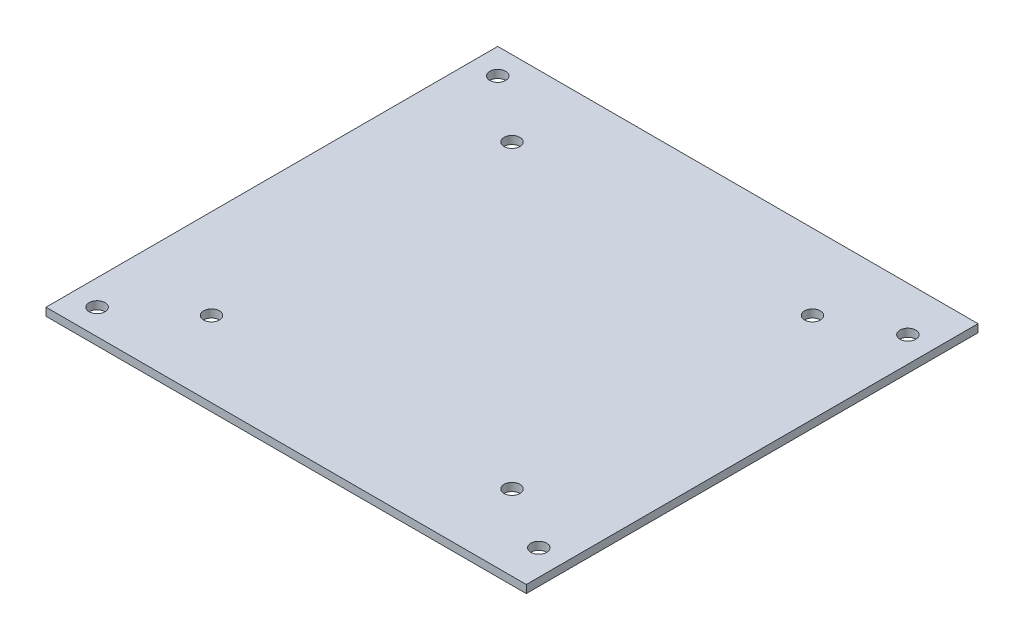
ISO-10303-21;
HEADER;
FILE_DESCRIPTION(('STEP AP214'),'2;1');
FILE_NAME('part.step','',(''),(''),'','','');
FILE_SCHEMA(('AUTOMOTIVE_DESIGN { 1 0 10303 214 1 1 1 1 }'));
ENDSEC;
DATA;
#1=APPLICATION_CONTEXT('core data for automotive mechanical design processes');
#2=APPLICATION_PROTOCOL_DEFINITION('international standard','automotive_design',2000,#1);
#3=PRODUCT_CONTEXT('',#1,'mechanical');
#4=PRODUCT('Part','Part','',(#3));
#5=PRODUCT_RELATED_PRODUCT_CATEGORY('part','',(#4));
#6=PRODUCT_DEFINITION_FORMATION('','',#4);
#7=PRODUCT_DEFINITION_CONTEXT('part definition',#1,'design');
#8=PRODUCT_DEFINITION('design','',#6,#7);
#9=PRODUCT_DEFINITION_SHAPE('','',#8);
#10=(LENGTH_UNIT() NAMED_UNIT(*) SI_UNIT(.MILLI.,.METRE.));
#11=(NAMED_UNIT(*) PLANE_ANGLE_UNIT() SI_UNIT($,.RADIAN.));
#12=(NAMED_UNIT(*) SI_UNIT($,.STERADIAN.) SOLID_ANGLE_UNIT());
#13=UNCERTAINTY_MEASURE_WITH_UNIT(LENGTH_MEASURE(1.E-05),#10,'distance_accuracy_value','');
#14=(GEOMETRIC_REPRESENTATION_CONTEXT(3) GLOBAL_UNCERTAINTY_ASSIGNED_CONTEXT((#13)) GLOBAL_UNIT_ASSIGNED_CONTEXT((#10,
#11,#12)) REPRESENTATION_CONTEXT('',''));
#15=CARTESIAN_POINT('',(0.,0.,0.));
#16=DIRECTION('',(0.,0.,1.));
#17=DIRECTION('',(1.,0.,0.));
#18=AXIS2_PLACEMENT_3D('',#15,#16,#17);
#19=CARTESIAN_POINT('',(0.,1.58,0.));
#20=DIRECTION('',(0.,1.,0.));
#21=DIRECTION('',(0.,0.,1.));
#22=AXIS2_PLACEMENT_3D('',#19,#20,#21);
#23=PLANE('',#22);
#24=CARTESIAN_POINT('',(42.85,1.58,37.5));
#25=DIRECTION('',(0.,1.,0.));
#26=DIRECTION('',(0.,0.,1.));
#27=AXIS2_PLACEMENT_3D('',#24,#25,#26);
#28=CIRCLE('',#27,1.5875);
#29=CARTESIAN_POINT('',(42.85,1.58,39.0875));
#30=VERTEX_POINT('',#29);
#31=EDGE_CURVE('E295',#30,#30,#28,.T.);
#32=ORIENTED_EDGE('',*,*,#31,.F.);
#33=EDGE_LOOP('',(#32));
#34=FACE_BOUND('',#33,.T.);
#35=CARTESIAN_POINT('',(30.,1.58,-30.));
#36=DIRECTION('',(0.,1.,0.));
#37=DIRECTION('',(0.,0.,1.));
#38=AXIS2_PLACEMENT_3D('',#35,#36,#37);
#39=CIRCLE('',#38,1.5875);
#40=CARTESIAN_POINT('',(30.,1.58,-28.4125));
#41=VERTEX_POINT('',#40);
#42=EDGE_CURVE('E307',#41,#41,#39,.T.);
#43=ORIENTED_EDGE('',*,*,#42,.F.);
#44=EDGE_LOOP('',(#43));
#45=FACE_BOUND('',#44,.T.);
#46=CARTESIAN_POINT('',(-30.,1.58,-29.9999999999983));
#47=DIRECTION('',(0.,1.,0.));
#48=DIRECTION('',(0.,0.,1.));
#49=AXIS2_PLACEMENT_3D('',#46,#47,#48);
#50=CIRCLE('',#49,1.5875);
#51=CARTESIAN_POINT('',(-30.,1.58,-28.4124999999983));
#52=VERTEX_POINT('',#51);
#53=EDGE_CURVE('E319',#52,#52,#50,.T.);
#54=ORIENTED_EDGE('',*,*,#53,.F.);
#55=EDGE_LOOP('',(#54));
#56=FACE_BOUND('',#55,.T.);
#57=CARTESIAN_POINT('',(-29.9999999999983,1.58,30.0000000000017));
#58=DIRECTION('',(0.,1.,0.));
#59=DIRECTION('',(0.,0.,1.));
#60=AXIS2_PLACEMENT_3D('',#57,#58,#59);
#61=CIRCLE('',#60,1.5875);
#62=CARTESIAN_POINT('',(-29.9999999999983,1.58,31.5875000000017));
#63=VERTEX_POINT('',#62);
#64=EDGE_CURVE('E224',#63,#63,#61,.T.);
#65=ORIENTED_EDGE('',*,*,#64,.F.);
#66=EDGE_LOOP('',(#65));
#67=FACE_BOUND('',#66,.T.);
#68=DIRECTION('',(1.,0.,0.));
#69=VECTOR('',#68,1.);
#70=CARTESIAN_POINT('',(-47.95,1.58,-45.1));
#71=LINE('',#70,#69);
#72=CARTESIAN_POINT('',(-47.95,1.58,-45.1));
#73=VERTEX_POINT('',#72);
#74=CARTESIAN_POINT('',(47.95,1.58,-45.1));
#75=VERTEX_POINT('',#74);
#76=EDGE_CURVE('E213',#73,#75,#71,.T.);
#77=ORIENTED_EDGE('',*,*,#76,.F.);
#78=DIRECTION('',(0.,0.,-1.));
#79=VECTOR('',#78,1.);
#80=CARTESIAN_POINT('',(-47.95,1.58,45.1));
#81=LINE('',#80,#79);
#82=CARTESIAN_POINT('',(-47.95,1.58,45.1));
#83=VERTEX_POINT('',#82);
#84=EDGE_CURVE('E203',#83,#73,#81,.T.);
#85=ORIENTED_EDGE('',*,*,#84,.F.);
#86=DIRECTION('',(1.,0.,0.));
#87=VECTOR('',#86,1.);
#88=CARTESIAN_POINT('',(-47.95,1.58,45.1));
#89=LINE('',#88,#87);
#90=CARTESIAN_POINT('',(47.95,1.58,45.1));
#91=VERTEX_POINT('',#90);
#92=EDGE_CURVE('E200',#83,#91,#89,.T.);
#93=ORIENTED_EDGE('',*,*,#92,.T.);
#94=DIRECTION('',(0.,0.,-1.));
#95=VECTOR('',#94,1.);
#96=CARTESIAN_POINT('',(47.95,1.58,45.1));
#97=LINE('',#96,#95);
#98=EDGE_CURVE('E197',#91,#75,#97,.T.);
#99=ORIENTED_EDGE('',*,*,#98,.T.);
#100=EDGE_LOOP('',(#77,#85,#93,#99));
#101=FACE_BOUND('',#100,.T.);
#102=CARTESIAN_POINT('',(-42.85,1.58,40.));
#103=DIRECTION('',(0.,1.,0.));
#104=DIRECTION('',(0.,0.,1.));
#105=AXIS2_PLACEMENT_3D('',#102,#103,#104);
#106=CIRCLE('',#105,1.5875);
#107=CARTESIAN_POINT('',(-42.85,1.58,41.5875));
#108=VERTEX_POINT('',#107);
#109=EDGE_CURVE('E325',#108,#108,#106,.T.);
#110=ORIENTED_EDGE('',*,*,#109,.F.);
#111=EDGE_LOOP('',(#110));
#112=FACE_BOUND('',#111,.T.);
#113=CARTESIAN_POINT('',(42.85,1.58,-36.2));
#114=DIRECTION('',(0.,1.,0.));
#115=DIRECTION('',(0.,0.,1.));
#116=AXIS2_PLACEMENT_3D('',#113,#114,#115);
#117=CIRCLE('',#116,1.5875);
#118=CARTESIAN_POINT('',(42.85,1.58,-34.6125));
#119=VERTEX_POINT('',#118);
#120=EDGE_CURVE('E313',#119,#119,#117,.T.);
#121=ORIENTED_EDGE('',*,*,#120,.F.);
#122=EDGE_LOOP('',(#121));
#123=FACE_BOUND('',#122,.T.);
#124=CARTESIAN_POINT('',(30.0000000000017,1.58,30.));
#125=DIRECTION('',(0.,1.,0.));
#126=DIRECTION('',(0.,0.,1.));
#127=AXIS2_PLACEMENT_3D('',#124,#125,#126);
#128=CIRCLE('',#127,1.5875);
#129=CARTESIAN_POINT('',(30.0000000000017,1.58,31.5875));
#130=VERTEX_POINT('',#129);
#131=EDGE_CURVE('E301',#130,#130,#128,.T.);
#132=ORIENTED_EDGE('',*,*,#131,.F.);
#133=EDGE_LOOP('',(#132));
#134=FACE_BOUND('',#133,.T.);
#135=CARTESIAN_POINT('',(-42.85,1.58,-40.));
#136=DIRECTION('',(0.,1.,0.));
#137=DIRECTION('',(0.,0.,1.));
#138=AXIS2_PLACEMENT_3D('',#135,#136,#137);
#139=CIRCLE('',#138,1.5875);
#140=CARTESIAN_POINT('',(-42.85,1.58,-38.4125));
#141=VERTEX_POINT('',#140);
#142=EDGE_CURVE('E286',#141,#141,#139,.T.);
#143=ORIENTED_EDGE('',*,*,#142,.F.);
#144=EDGE_LOOP('',(#143));
#145=FACE_BOUND('',#144,.T.);
#146=ADVANCED_FACE('F154',(#34,#45,#56,#67,#101,#112,#123,#134,#145),#23,.T.);
#147=CARTESIAN_POINT('',(0.,0.,0.));
#148=DIRECTION('',(0.,1.,0.));
#149=DIRECTION('',(0.,0.,1.));
#150=AXIS2_PLACEMENT_3D('',#147,#148,#149);
#151=PLANE('',#150);
#152=DIRECTION('',(1.,0.,0.));
#153=VECTOR('',#152,1.);
#154=CARTESIAN_POINT('',(-47.95,0.,-45.1));
#155=LINE('',#154,#153);
#156=CARTESIAN_POINT('',(-47.95,0.,-45.1));
#157=VERTEX_POINT('',#156);
#158=CARTESIAN_POINT('',(47.95,0.,-45.1));
#159=VERTEX_POINT('',#158);
#160=EDGE_CURVE('E220',#157,#159,#155,.T.);
#161=ORIENTED_EDGE('',*,*,#160,.T.);
#162=DIRECTION('',(0.,0.,-1.));
#163=VECTOR('',#162,1.);
#164=CARTESIAN_POINT('',(47.95,0.,45.1));
#165=LINE('',#164,#163);
#166=CARTESIAN_POINT('',(47.95,0.,45.1));
#167=VERTEX_POINT('',#166);
#168=EDGE_CURVE('E223',#167,#159,#165,.T.);
#169=ORIENTED_EDGE('',*,*,#168,.F.);
#170=DIRECTION('',(1.,0.,0.));
#171=VECTOR('',#170,1.);
#172=CARTESIAN_POINT('',(-47.95,0.,45.1));
#173=LINE('',#172,#171);
#174=CARTESIAN_POINT('',(-47.95,0.,45.1));
#175=VERTEX_POINT('',#174);
#176=EDGE_CURVE('E208',#175,#167,#173,.T.);
#177=ORIENTED_EDGE('',*,*,#176,.F.);
#178=DIRECTION('',(0.,0.,-1.));
#179=VECTOR('',#178,1.);
#180=CARTESIAN_POINT('',(-47.95,0.,45.1));
#181=LINE('',#180,#179);
#182=EDGE_CURVE('E215',#175,#157,#181,.T.);
#183=ORIENTED_EDGE('',*,*,#182,.T.);
#184=EDGE_LOOP('',(#161,#169,#177,#183));
#185=FACE_BOUND('',#184,.T.);
#186=CARTESIAN_POINT('',(-29.9999999999983,0.,30.0000000000017));
#187=DIRECTION('',(0.,1.,0.));
#188=DIRECTION('',(0.,0.,1.));
#189=AXIS2_PLACEMENT_3D('',#186,#187,#188);
#190=CIRCLE('',#189,1.5875);
#191=CARTESIAN_POINT('',(-29.9999999999983,0.,31.5875000000017));
#192=VERTEX_POINT('',#191);
#193=EDGE_CURVE('E328',#192,#192,#190,.T.);
#194=ORIENTED_EDGE('',*,*,#193,.T.);
#195=EDGE_LOOP('',(#194));
#196=FACE_BOUND('',#195,.T.);
#197=CARTESIAN_POINT('',(-42.85,0.,40.));
#198=DIRECTION('',(0.,1.,0.));
#199=DIRECTION('',(0.,0.,1.));
#200=AXIS2_PLACEMENT_3D('',#197,#198,#199);
#201=CIRCLE('',#200,1.5875);
#202=CARTESIAN_POINT('',(-42.85,0.,41.5875));
#203=VERTEX_POINT('',#202);
#204=EDGE_CURVE('E322',#203,#203,#201,.T.);
#205=ORIENTED_EDGE('',*,*,#204,.T.);
#206=EDGE_LOOP('',(#205));
#207=FACE_BOUND('',#206,.T.);
#208=CARTESIAN_POINT('',(-30.,0.,-29.9999999999983));
#209=DIRECTION('',(0.,1.,0.));
#210=DIRECTION('',(0.,0.,1.));
#211=AXIS2_PLACEMENT_3D('',#208,#209,#210);
#212=CIRCLE('',#211,1.5875);
#213=CARTESIAN_POINT('',(-30.,0.,-28.4124999999983));
#214=VERTEX_POINT('',#213);
#215=EDGE_CURVE('E316',#214,#214,#212,.T.);
#216=ORIENTED_EDGE('',*,*,#215,.T.);
#217=EDGE_LOOP('',(#216));
#218=FACE_BOUND('',#217,.T.);
#219=CARTESIAN_POINT('',(42.85,0.,-36.2));
#220=DIRECTION('',(0.,1.,0.));
#221=DIRECTION('',(0.,0.,1.));
#222=AXIS2_PLACEMENT_3D('',#219,#220,#221);
#223=CIRCLE('',#222,1.5875);
#224=CARTESIAN_POINT('',(42.85,0.,-34.6125));
#225=VERTEX_POINT('',#224);
#226=EDGE_CURVE('E310',#225,#225,#223,.T.);
#227=ORIENTED_EDGE('',*,*,#226,.T.);
#228=EDGE_LOOP('',(#227));
#229=FACE_BOUND('',#228,.T.);
#230=CARTESIAN_POINT('',(30.,0.,-30.));
#231=DIRECTION('',(0.,1.,0.));
#232=DIRECTION('',(0.,0.,1.));
#233=AXIS2_PLACEMENT_3D('',#230,#231,#232);
#234=CIRCLE('',#233,1.5875);
#235=CARTESIAN_POINT('',(30.,0.,-28.4125));
#236=VERTEX_POINT('',#235);
#237=EDGE_CURVE('E304',#236,#236,#234,.T.);
#238=ORIENTED_EDGE('',*,*,#237,.T.);
#239=EDGE_LOOP('',(#238));
#240=FACE_BOUND('',#239,.T.);
#241=CARTESIAN_POINT('',(30.0000000000017,0.,30.));
#242=DIRECTION('',(0.,1.,0.));
#243=DIRECTION('',(0.,0.,1.));
#244=AXIS2_PLACEMENT_3D('',#241,#242,#243);
#245=CIRCLE('',#244,1.5875);
#246=CARTESIAN_POINT('',(30.0000000000017,0.,31.5875));
#247=VERTEX_POINT('',#246);
#248=EDGE_CURVE('E298',#247,#247,#245,.T.);
#249=ORIENTED_EDGE('',*,*,#248,.T.);
#250=EDGE_LOOP('',(#249));
#251=FACE_BOUND('',#250,.T.);
#252=CARTESIAN_POINT('',(42.85,0.,37.5));
#253=DIRECTION('',(0.,1.,0.));
#254=DIRECTION('',(0.,0.,1.));
#255=AXIS2_PLACEMENT_3D('',#252,#253,#254);
#256=CIRCLE('',#255,1.5875);
#257=CARTESIAN_POINT('',(42.85,0.,39.0875));
#258=VERTEX_POINT('',#257);
#259=EDGE_CURVE('E292',#258,#258,#256,.T.);
#260=ORIENTED_EDGE('',*,*,#259,.T.);
#261=EDGE_LOOP('',(#260));
#262=FACE_BOUND('',#261,.T.);
#263=CARTESIAN_POINT('',(-42.85,0.,-40.));
#264=DIRECTION('',(0.,1.,0.));
#265=DIRECTION('',(0.,0.,1.));
#266=AXIS2_PLACEMENT_3D('',#263,#264,#265);
#267=CIRCLE('',#266,1.5875);
#268=CARTESIAN_POINT('',(-42.85,0.,-38.4125));
#269=VERTEX_POINT('',#268);
#270=EDGE_CURVE('E289',#269,#269,#267,.T.);
#271=ORIENTED_EDGE('',*,*,#270,.T.);
#272=EDGE_LOOP('',(#271));
#273=FACE_BOUND('',#272,.T.);
#274=ADVANCED_FACE('F230',(#185,#196,#207,#218,#229,#240,#251,#262,#273),#151,.F.);
#275=CARTESIAN_POINT('',(-47.95,1.58,-45.1));
#276=DIRECTION('',(0.,0.,-1.));
#277=DIRECTION('',(-1.,0.,0.));
#278=AXIS2_PLACEMENT_3D('',#275,#276,#277);
#279=PLANE('',#278);
#280=ORIENTED_EDGE('',*,*,#160,.F.);
#281=DIRECTION('',(0.,-1.,0.));
#282=VECTOR('',#281,1.);
#283=CARTESIAN_POINT('',(-47.95,1.58,-45.1));
#284=LINE('',#283,#282);
#285=EDGE_CURVE('E12',#73,#157,#284,.T.);
#286=ORIENTED_EDGE('',*,*,#285,.F.);
#287=ORIENTED_EDGE('',*,*,#76,.T.);
#288=DIRECTION('',(0.,-1.,0.));
#289=VECTOR('',#288,1.);
#290=CARTESIAN_POINT('',(47.95,1.58,-45.1));
#291=LINE('',#290,#289);
#292=EDGE_CURVE('E158',#75,#159,#291,.T.);
#293=ORIENTED_EDGE('',*,*,#292,.T.);
#294=EDGE_LOOP('',(#280,#286,#287,#293));
#295=FACE_BOUND('',#294,.T.);
#296=ADVANCED_FACE('F156',(#295),#279,.T.);
#297=CARTESIAN_POINT('',(-47.95,1.58,45.1));
#298=DIRECTION('',(-1.,0.,0.));
#299=DIRECTION('',(0.,0.,1.));
#300=AXIS2_PLACEMENT_3D('',#297,#298,#299);
#301=PLANE('',#300);
#302=ORIENTED_EDGE('',*,*,#182,.F.);
#303=DIRECTION('',(0.,-1.,0.));
#304=VECTOR('',#303,1.);
#305=CARTESIAN_POINT('',(-47.95,1.58,45.1));
#306=LINE('',#305,#304);
#307=EDGE_CURVE('E164',#83,#175,#306,.T.);
#308=ORIENTED_EDGE('',*,*,#307,.F.);
#309=ORIENTED_EDGE('',*,*,#84,.T.);
#310=ORIENTED_EDGE('',*,*,#285,.T.);
#311=EDGE_LOOP('',(#302,#308,#309,#310));
#312=FACE_BOUND('',#311,.T.);
#313=ADVANCED_FACE('F232',(#312),#301,.T.);
#314=CARTESIAN_POINT('',(-47.95,1.58,45.1));
#315=DIRECTION('',(0.,0.,-1.));
#316=DIRECTION('',(-1.,0.,0.));
#317=AXIS2_PLACEMENT_3D('',#314,#315,#316);
#318=PLANE('',#317);
#319=ORIENTED_EDGE('',*,*,#176,.T.);
#320=DIRECTION('',(0.,-1.,0.));
#321=VECTOR('',#320,1.);
#322=CARTESIAN_POINT('',(47.95,1.58,45.1));
#323=LINE('',#322,#321);
#324=EDGE_CURVE('E206',#91,#167,#323,.T.);
#325=ORIENTED_EDGE('',*,*,#324,.F.);
#326=ORIENTED_EDGE('',*,*,#92,.F.);
#327=ORIENTED_EDGE('',*,*,#307,.T.);
#328=EDGE_LOOP('',(#319,#325,#326,#327));
#329=FACE_BOUND('',#328,.T.);
#330=ADVANCED_FACE('F207',(#329),#318,.F.);
#331=CARTESIAN_POINT('',(47.95,1.58,45.1));
#332=DIRECTION('',(-1.,0.,0.));
#333=DIRECTION('',(0.,0.,1.));
#334=AXIS2_PLACEMENT_3D('',#331,#332,#333);
#335=PLANE('',#334);
#336=ORIENTED_EDGE('',*,*,#168,.T.);
#337=ORIENTED_EDGE('',*,*,#292,.F.);
#338=ORIENTED_EDGE('',*,*,#98,.F.);
#339=ORIENTED_EDGE('',*,*,#324,.T.);
#340=EDGE_LOOP('',(#336,#337,#338,#339));
#341=FACE_BOUND('',#340,.T.);
#342=ADVANCED_FACE('F212',(#341),#335,.F.);
#343=CARTESIAN_POINT('',(-29.9999999999983,1.58,30.0000000000017));
#344=DIRECTION('',(0.,-1.,0.));
#345=DIRECTION('',(0.,0.,-1.));
#346=AXIS2_PLACEMENT_3D('',#343,#344,#345);
#347=CYLINDRICAL_SURFACE('',#346,1.5875);
#348=ORIENTED_EDGE('',*,*,#64,.T.);
#349=EDGE_LOOP('',(#348));
#350=FACE_BOUND('',#349,.T.);
#351=ORIENTED_EDGE('',*,*,#193,.F.);
#352=EDGE_LOOP('',(#351));
#353=FACE_BOUND('',#352,.T.);
#354=ADVANCED_FACE('F250',(#350,#353),#347,.F.);
#355=CARTESIAN_POINT('',(-42.85,1.58,40.));
#356=DIRECTION('',(0.,-1.,0.));
#357=DIRECTION('',(0.,0.,-1.));
#358=AXIS2_PLACEMENT_3D('',#355,#356,#357);
#359=CYLINDRICAL_SURFACE('',#358,1.5875);
#360=ORIENTED_EDGE('',*,*,#109,.T.);
#361=EDGE_LOOP('',(#360));
#362=FACE_BOUND('',#361,.T.);
#363=ORIENTED_EDGE('',*,*,#204,.F.);
#364=EDGE_LOOP('',(#363));
#365=FACE_BOUND('',#364,.T.);
#366=ADVANCED_FACE('F253',(#362,#365),#359,.F.);
#367=CARTESIAN_POINT('',(-30.,1.58,-29.9999999999983));
#368=DIRECTION('',(0.,-1.,0.));
#369=DIRECTION('',(0.,0.,-1.));
#370=AXIS2_PLACEMENT_3D('',#367,#368,#369);
#371=CYLINDRICAL_SURFACE('',#370,1.5875);
#372=ORIENTED_EDGE('',*,*,#53,.T.);
#373=EDGE_LOOP('',(#372));
#374=FACE_BOUND('',#373,.T.);
#375=ORIENTED_EDGE('',*,*,#215,.F.);
#376=EDGE_LOOP('',(#375));
#377=FACE_BOUND('',#376,.T.);
#378=ADVANCED_FACE('F257',(#374,#377),#371,.F.);
#379=CARTESIAN_POINT('',(42.85,1.58,-36.2));
#380=DIRECTION('',(0.,-1.,0.));
#381=DIRECTION('',(0.,0.,-1.));
#382=AXIS2_PLACEMENT_3D('',#379,#380,#381);
#383=CYLINDRICAL_SURFACE('',#382,1.5875);
#384=ORIENTED_EDGE('',*,*,#120,.T.);
#385=EDGE_LOOP('',(#384));
#386=FACE_BOUND('',#385,.T.);
#387=ORIENTED_EDGE('',*,*,#226,.F.);
#388=EDGE_LOOP('',(#387));
#389=FACE_BOUND('',#388,.T.);
#390=ADVANCED_FACE('F261',(#386,#389),#383,.F.);
#391=CARTESIAN_POINT('',(30.,1.58,-30.));
#392=DIRECTION('',(0.,-1.,0.));
#393=DIRECTION('',(0.,0.,-1.));
#394=AXIS2_PLACEMENT_3D('',#391,#392,#393);
#395=CYLINDRICAL_SURFACE('',#394,1.5875);
#396=ORIENTED_EDGE('',*,*,#42,.T.);
#397=EDGE_LOOP('',(#396));
#398=FACE_BOUND('',#397,.T.);
#399=ORIENTED_EDGE('',*,*,#237,.F.);
#400=EDGE_LOOP('',(#399));
#401=FACE_BOUND('',#400,.T.);
#402=ADVANCED_FACE('F265',(#398,#401),#395,.F.);
#403=CARTESIAN_POINT('',(30.0000000000017,1.58,30.));
#404=DIRECTION('',(0.,-1.,0.));
#405=DIRECTION('',(0.,0.,-1.));
#406=AXIS2_PLACEMENT_3D('',#403,#404,#405);
#407=CYLINDRICAL_SURFACE('',#406,1.5875);
#408=ORIENTED_EDGE('',*,*,#131,.T.);
#409=EDGE_LOOP('',(#408));
#410=FACE_BOUND('',#409,.T.);
#411=ORIENTED_EDGE('',*,*,#248,.F.);
#412=EDGE_LOOP('',(#411));
#413=FACE_BOUND('',#412,.T.);
#414=ADVANCED_FACE('F269',(#410,#413),#407,.F.);
#415=CARTESIAN_POINT('',(42.85,1.58,37.5));
#416=DIRECTION('',(0.,-1.,0.));
#417=DIRECTION('',(0.,0.,-1.));
#418=AXIS2_PLACEMENT_3D('',#415,#416,#417);
#419=CYLINDRICAL_SURFACE('',#418,1.5875);
#420=ORIENTED_EDGE('',*,*,#31,.T.);
#421=EDGE_LOOP('',(#420));
#422=FACE_BOUND('',#421,.T.);
#423=ORIENTED_EDGE('',*,*,#259,.F.);
#424=EDGE_LOOP('',(#423));
#425=FACE_BOUND('',#424,.T.);
#426=ADVANCED_FACE('F273',(#422,#425),#419,.F.);
#427=CARTESIAN_POINT('',(-42.85,1.58,-40.));
#428=DIRECTION('',(0.,-1.,0.));
#429=DIRECTION('',(0.,0.,-1.));
#430=AXIS2_PLACEMENT_3D('',#427,#428,#429);
#431=CYLINDRICAL_SURFACE('',#430,1.5875);
#432=ORIENTED_EDGE('',*,*,#142,.T.);
#433=EDGE_LOOP('',(#432));
#434=FACE_BOUND('',#433,.T.);
#435=ORIENTED_EDGE('',*,*,#270,.F.);
#436=EDGE_LOOP('',(#435));
#437=FACE_BOUND('',#436,.T.);
#438=ADVANCED_FACE('F277',(#434,#437),#431,.F.);
#439=CLOSED_SHELL('',(#146,#274,#296,#313,#330,#342,#354,#366,#378,#390,#402,#414,#426,#438));
#440=MANIFOLD_SOLID_BREP('B2',#439);
#441=ADVANCED_BREP_SHAPE_REPRESENTATION('',(#18,#440),#14);
#442=SHAPE_DEFINITION_REPRESENTATION(#9,#441);
ENDSEC;
END-ISO-10303-21;
